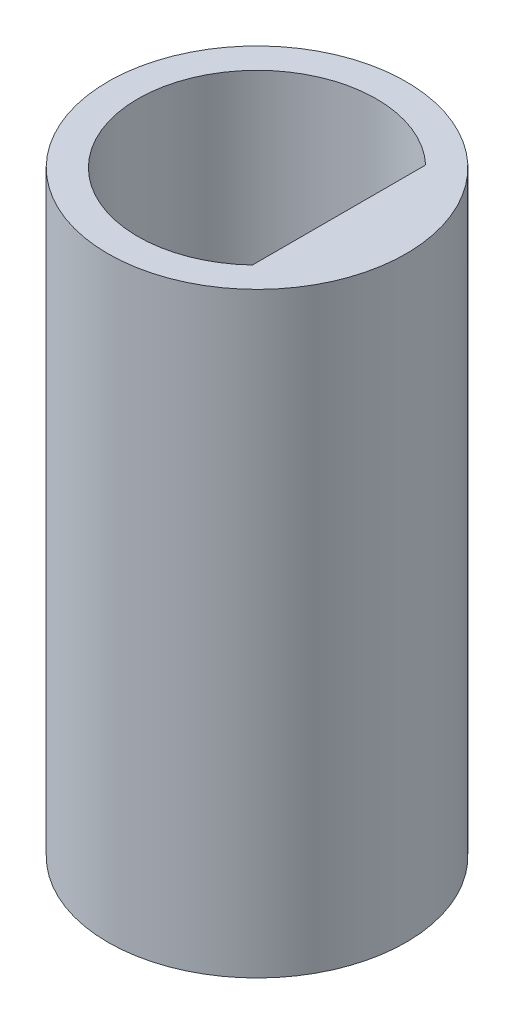
ISO-10303-21;
HEADER;
FILE_DESCRIPTION(('STEP AP214'),'2;1');
FILE_NAME('part.step','',(''),(''),'','','');
FILE_SCHEMA(('AUTOMOTIVE_DESIGN { 1 0 10303 214 1 1 1 1 }'));
ENDSEC;
DATA;
#1=APPLICATION_CONTEXT('core data for automotive mechanical design processes');
#2=APPLICATION_PROTOCOL_DEFINITION('international standard','automotive_design',2000,#1);
#3=PRODUCT_CONTEXT('',#1,'mechanical');
#4=PRODUCT('Part','Part','',(#3));
#5=PRODUCT_RELATED_PRODUCT_CATEGORY('part','',(#4));
#6=PRODUCT_DEFINITION_FORMATION('','',#4);
#7=PRODUCT_DEFINITION_CONTEXT('part definition',#1,'design');
#8=PRODUCT_DEFINITION('design','',#6,#7);
#9=PRODUCT_DEFINITION_SHAPE('','',#8);
#10=(LENGTH_UNIT() NAMED_UNIT(*) SI_UNIT(.MILLI.,.METRE.));
#11=(NAMED_UNIT(*) PLANE_ANGLE_UNIT() SI_UNIT($,.RADIAN.));
#12=(NAMED_UNIT(*) SI_UNIT($,.STERADIAN.) SOLID_ANGLE_UNIT());
#13=UNCERTAINTY_MEASURE_WITH_UNIT(LENGTH_MEASURE(1.E-05),#10,'distance_accuracy_value','');
#14=(GEOMETRIC_REPRESENTATION_CONTEXT(3) GLOBAL_UNCERTAINTY_ASSIGNED_CONTEXT((#13)) GLOBAL_UNIT_ASSIGNED_CONTEXT((#10,
#11,#12)) REPRESENTATION_CONTEXT('',''));
#15=CARTESIAN_POINT('',(0.,0.,0.));
#16=DIRECTION('',(0.,0.,1.));
#17=DIRECTION('',(1.,0.,0.));
#18=AXIS2_PLACEMENT_3D('',#15,#16,#17);
#19=CARTESIAN_POINT('',(0.,8.,0.));
#20=DIRECTION('',(0.,1.,0.));
#21=DIRECTION('',(0.,0.,1.));
#22=AXIS2_PLACEMENT_3D('',#19,#20,#21);
#23=PLANE('',#22);
#24=CARTESIAN_POINT('',(0.,8.,0.));
#25=DIRECTION('',(0.,1.,0.));
#26=DIRECTION('',(0.,0.,1.));
#27=AXIS2_PLACEMENT_3D('',#24,#25,#26);
#28=CIRCLE('',#27,2.);
#29=CARTESIAN_POINT('',(0.,8.,2.));
#30=VERTEX_POINT('',#29);
#31=EDGE_CURVE('E11',#30,#30,#28,.T.);
#32=ORIENTED_EDGE('',*,*,#31,.T.);
#33=EDGE_LOOP('',(#32));
#34=FACE_BOUND('',#33,.T.);
#35=DIRECTION('',(0.,0.,-1.));
#36=VECTOR('',#35,1.);
#37=CARTESIAN_POINT('',(1.1,8.,-1.16189500386223));
#38=LINE('',#37,#36);
#39=CARTESIAN_POINT('',(1.1,8.,1.16189500386223));
#40=VERTEX_POINT('',#39);
#41=CARTESIAN_POINT('',(1.1,8.,-1.16189500386223));
#42=VERTEX_POINT('',#41);
#43=EDGE_CURVE('E74',#40,#42,#38,.T.);
#44=ORIENTED_EDGE('',*,*,#43,.F.);
#45=CARTESIAN_POINT('',(0.,8.,0.));
#46=DIRECTION('',(0.,1.,0.));
#47=DIRECTION('',(0.,0.,1.));
#48=AXIS2_PLACEMENT_3D('',#45,#46,#47);
#49=CIRCLE('',#48,1.6);
#50=EDGE_CURVE('E65',#42,#40,#49,.T.);
#51=ORIENTED_EDGE('',*,*,#50,.F.);
#52=EDGE_LOOP('',(#44,#51));
#53=FACE_BOUND('',#52,.T.);
#54=ADVANCED_FACE('F33',(#34,#53),#23,.T.);
#55=CARTESIAN_POINT('',(0.,0.,0.));
#56=DIRECTION('',(0.,1.,0.));
#57=DIRECTION('',(0.,0.,1.));
#58=AXIS2_PLACEMENT_3D('',#55,#56,#57);
#59=PLANE('',#58);
#60=CARTESIAN_POINT('',(0.,0.,0.));
#61=DIRECTION('',(0.,1.,0.));
#62=DIRECTION('',(0.,0.,1.));
#63=AXIS2_PLACEMENT_3D('',#60,#61,#62);
#64=CIRCLE('',#63,2.);
#65=CARTESIAN_POINT('',(0.,0.,2.));
#66=VERTEX_POINT('',#65);
#67=EDGE_CURVE('E37',#66,#66,#64,.T.);
#68=ORIENTED_EDGE('',*,*,#67,.F.);
#69=EDGE_LOOP('',(#68));
#70=FACE_BOUND('',#69,.T.);
#71=CARTESIAN_POINT('',(0.,0.,0.));
#72=DIRECTION('',(0.,1.,0.));
#73=DIRECTION('',(0.,0.,1.));
#74=AXIS2_PLACEMENT_3D('',#71,#72,#73);
#75=CIRCLE('',#74,1.6);
#76=CARTESIAN_POINT('',(1.1,0.,-1.16189500386223));
#77=VERTEX_POINT('',#76);
#78=CARTESIAN_POINT('',(1.1,0.,1.16189500386223));
#79=VERTEX_POINT('',#78);
#80=EDGE_CURVE('E55',#77,#79,#75,.T.);
#81=ORIENTED_EDGE('',*,*,#80,.T.);
#82=DIRECTION('',(0.,0.,-1.));
#83=VECTOR('',#82,1.);
#84=CARTESIAN_POINT('',(1.1,0.,-1.16189500386223));
#85=LINE('',#84,#83);
#86=EDGE_CURVE('E61',#79,#77,#85,.T.);
#87=ORIENTED_EDGE('',*,*,#86,.T.);
#88=EDGE_LOOP('',(#81,#87));
#89=FACE_BOUND('',#88,.T.);
#90=ADVANCED_FACE('F71',(#70,#89),#59,.F.);
#91=CARTESIAN_POINT('',(0.,8.,0.));
#92=DIRECTION('',(0.,-1.,0.));
#93=DIRECTION('',(0.,0.,-1.));
#94=AXIS2_PLACEMENT_3D('',#91,#92,#93);
#95=CYLINDRICAL_SURFACE('',#94,2.);
#96=ORIENTED_EDGE('',*,*,#31,.F.);
#97=EDGE_LOOP('',(#96));
#98=FACE_BOUND('',#97,.T.);
#99=ORIENTED_EDGE('',*,*,#67,.T.);
#100=EDGE_LOOP('',(#99));
#101=FACE_BOUND('',#100,.T.);
#102=ADVANCED_FACE('F35',(#98,#101),#95,.T.);
#103=CARTESIAN_POINT('',(0.,8.,0.));
#104=DIRECTION('',(0.,-1.,0.));
#105=DIRECTION('',(0.,0.,-1.));
#106=AXIS2_PLACEMENT_3D('',#103,#104,#105);
#107=CYLINDRICAL_SURFACE('',#106,1.6);
#108=ORIENTED_EDGE('',*,*,#80,.F.);
#109=DIRECTION('',(0.,-1.,0.));
#110=VECTOR('',#109,1.);
#111=CARTESIAN_POINT('',(1.1,8.,-1.16189500386223));
#112=LINE('',#111,#110);
#113=EDGE_CURVE('E63',#42,#77,#112,.T.);
#114=ORIENTED_EDGE('',*,*,#113,.F.);
#115=ORIENTED_EDGE('',*,*,#50,.T.);
#116=DIRECTION('',(0.,-1.,0.));
#117=VECTOR('',#116,1.);
#118=CARTESIAN_POINT('',(1.1,8.,1.16189500386223));
#119=LINE('',#118,#117);
#120=EDGE_CURVE('E48',#40,#79,#119,.T.);
#121=ORIENTED_EDGE('',*,*,#120,.T.);
#122=EDGE_LOOP('',(#108,#114,#115,#121));
#123=FACE_BOUND('',#122,.T.);
#124=ADVANCED_FACE('F67',(#123),#107,.F.);
#125=CARTESIAN_POINT('',(1.1,8.,-1.16189500386223));
#126=DIRECTION('',(-1.,0.,0.));
#127=DIRECTION('',(0.,0.,1.));
#128=AXIS2_PLACEMENT_3D('',#125,#126,#127);
#129=PLANE('',#128);
#130=ORIENTED_EDGE('',*,*,#86,.F.);
#131=ORIENTED_EDGE('',*,*,#120,.F.);
#132=ORIENTED_EDGE('',*,*,#43,.T.);
#133=ORIENTED_EDGE('',*,*,#113,.T.);
#134=EDGE_LOOP('',(#130,#131,#132,#133));
#135=FACE_BOUND('',#134,.T.);
#136=ADVANCED_FACE('F62',(#135),#129,.T.);
#137=CLOSED_SHELL('',(#54,#90,#102,#124,#136));
#138=MANIFOLD_SOLID_BREP('B2',#137);
#139=ADVANCED_BREP_SHAPE_REPRESENTATION('',(#18,#138),#14);
#140=SHAPE_DEFINITION_REPRESENTATION(#9,#139);
ENDSEC;
END-ISO-10303-21;
